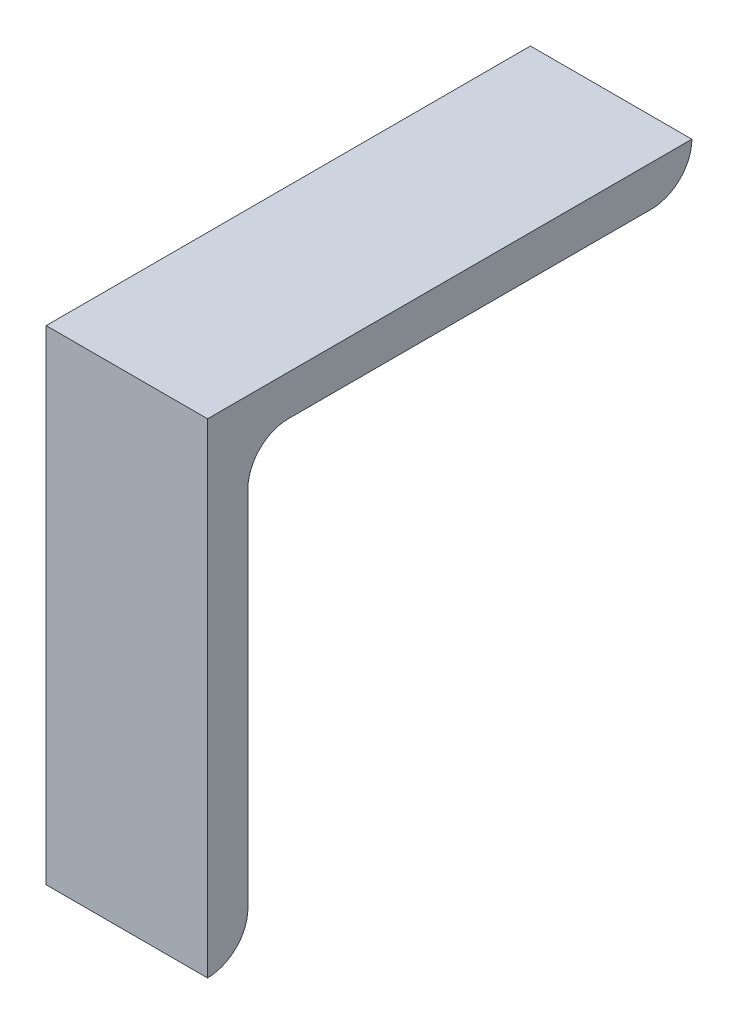
ISO-10303-21;
HEADER;
FILE_DESCRIPTION(('STEP AP214'),'2;1');
FILE_NAME('part.step','',(''),(''),'','','');
FILE_SCHEMA(('AUTOMOTIVE_DESIGN { 1 0 10303 214 1 1 1 1 }'));
ENDSEC;
DATA;
#1=APPLICATION_CONTEXT('core data for automotive mechanical design processes');
#2=APPLICATION_PROTOCOL_DEFINITION('international standard','automotive_design',2000,#1);
#3=PRODUCT_CONTEXT('',#1,'mechanical');
#4=PRODUCT('Part','Part','',(#3));
#5=PRODUCT_RELATED_PRODUCT_CATEGORY('part','',(#4));
#6=PRODUCT_DEFINITION_FORMATION('','',#4);
#7=PRODUCT_DEFINITION_CONTEXT('part definition',#1,'design');
#8=PRODUCT_DEFINITION('design','',#6,#7);
#9=PRODUCT_DEFINITION_SHAPE('','',#8);
#10=(LENGTH_UNIT() NAMED_UNIT(*) SI_UNIT(.MILLI.,.METRE.));
#11=(NAMED_UNIT(*) PLANE_ANGLE_UNIT() SI_UNIT($,.RADIAN.));
#12=(NAMED_UNIT(*) SI_UNIT($,.STERADIAN.) SOLID_ANGLE_UNIT());
#13=UNCERTAINTY_MEASURE_WITH_UNIT(LENGTH_MEASURE(1.E-05),#10,'distance_accuracy_value','');
#14=(GEOMETRIC_REPRESENTATION_CONTEXT(3) GLOBAL_UNCERTAINTY_ASSIGNED_CONTEXT((#13)) GLOBAL_UNIT_ASSIGNED_CONTEXT((#10,
#11,#12)) REPRESENTATION_CONTEXT('',''));
#15=CARTESIAN_POINT('',(0.,0.,0.));
#16=DIRECTION('',(0.,0.,1.));
#17=DIRECTION('',(1.,0.,0.));
#18=AXIS2_PLACEMENT_3D('',#15,#16,#17);
#19=CARTESIAN_POINT('',(45.81144,0.,-69.85));
#20=DIRECTION('',(-1.,0.,0.));
#21=DIRECTION('',(0.,0.,1.));
#22=AXIS2_PLACEMENT_3D('',#19,#20,#21);
#23=CYLINDRICAL_SURFACE('',#22,6.35);
#24=DIRECTION('',(1.,0.,0.));
#25=VECTOR('',#24,1.);
#26=CARTESIAN_POINT('',(-12.7,-6.35,-69.85));
#27=LINE('',#26,#25);
#28=CARTESIAN_POINT('',(-12.7,-6.35,-69.85));
#29=VERTEX_POINT('',#28);
#30=CARTESIAN_POINT('',(12.7,-6.35,-69.85));
#31=VERTEX_POINT('',#30);
#32=EDGE_CURVE('E86',#29,#31,#27,.T.);
#33=ORIENTED_EDGE('',*,*,#32,.F.);
#34=CARTESIAN_POINT('',(-12.7,0.,-69.85));
#35=DIRECTION('',(-1.,0.,0.));
#36=DIRECTION('',(0.,0.,1.));
#37=AXIS2_PLACEMENT_3D('',#34,#35,#36);
#38=CIRCLE('',#37,6.35);
#39=CARTESIAN_POINT('',(-12.7,0.,-76.2));
#40=VERTEX_POINT('',#39);
#41=EDGE_CURVE('E111',#29,#40,#38,.F.);
#42=ORIENTED_EDGE('',*,*,#41,.T.);
#43=DIRECTION('',(1.,0.,0.));
#44=VECTOR('',#43,1.);
#45=CARTESIAN_POINT('',(-12.7,0.,-76.2));
#46=LINE('',#45,#44);
#47=CARTESIAN_POINT('',(12.7,0.,-76.2));
#48=VERTEX_POINT('',#47);
#49=EDGE_CURVE('E108',#48,#40,#46,.F.);
#50=ORIENTED_EDGE('',*,*,#49,.F.);
#51=CARTESIAN_POINT('',(12.7,0.,-69.85));
#52=DIRECTION('',(-1.,0.,0.));
#53=DIRECTION('',(0.,0.,1.));
#54=AXIS2_PLACEMENT_3D('',#51,#52,#53);
#55=CIRCLE('',#54,6.35);
#56=EDGE_CURVE('E93',#31,#48,#55,.F.);
#57=ORIENTED_EDGE('',*,*,#56,.F.);
#58=EDGE_LOOP('',(#33,#42,#50,#57));
#59=FACE_BOUND('',#58,.T.);
#60=ADVANCED_FACE('F16',(#59),#23,.T.);
#61=CARTESIAN_POINT('',(-45.81144,-12.7,-12.7));
#62=DIRECTION('',(1.,0.,0.));
#63=DIRECTION('',(0.,0.,-1.));
#64=AXIS2_PLACEMENT_3D('',#61,#62,#63);
#65=CYLINDRICAL_SURFACE('',#64,6.35);
#66=DIRECTION('',(-1.,0.,0.));
#67=VECTOR('',#66,1.);
#68=CARTESIAN_POINT('',(-12.7,-12.7,-6.35));
#69=LINE('',#68,#67);
#70=CARTESIAN_POINT('',(-12.7,-12.7,-6.35));
#71=VERTEX_POINT('',#70);
#72=CARTESIAN_POINT('',(12.7,-12.7,-6.35));
#73=VERTEX_POINT('',#72);
#74=EDGE_CURVE('E71',#71,#73,#69,.F.);
#75=ORIENTED_EDGE('',*,*,#74,.F.);
#76=CARTESIAN_POINT('',(-12.7,-12.7,-12.7));
#77=DIRECTION('',(1.,0.,0.));
#78=DIRECTION('',(0.,0.,-1.));
#79=AXIS2_PLACEMENT_3D('',#76,#77,#78);
#80=CIRCLE('',#79,6.35);
#81=CARTESIAN_POINT('',(-12.7,-6.35,-12.7));
#82=VERTEX_POINT('',#81);
#83=EDGE_CURVE('E82',#71,#82,#80,.F.);
#84=ORIENTED_EDGE('',*,*,#83,.T.);
#85=DIRECTION('',(1.,0.,0.));
#86=VECTOR('',#85,1.);
#87=CARTESIAN_POINT('',(-12.7,-6.35,-12.7));
#88=LINE('',#87,#86);
#89=CARTESIAN_POINT('',(12.7,-6.35,-12.7));
#90=VERTEX_POINT('',#89);
#91=EDGE_CURVE('E76',#90,#82,#88,.F.);
#92=ORIENTED_EDGE('',*,*,#91,.F.);
#93=CARTESIAN_POINT('',(12.7,-12.7,-12.7));
#94=DIRECTION('',(1.,0.,0.));
#95=DIRECTION('',(0.,0.,-1.));
#96=AXIS2_PLACEMENT_3D('',#93,#94,#95);
#97=CIRCLE('',#96,6.35);
#98=EDGE_CURVE('E19',#73,#90,#97,.F.);
#99=ORIENTED_EDGE('',*,*,#98,.F.);
#100=EDGE_LOOP('',(#75,#84,#92,#99));
#101=FACE_BOUND('',#100,.T.);
#102=ADVANCED_FACE('F78',(#101),#65,.F.);
#103=CARTESIAN_POINT('',(-12.7,-6.35,-6.35));
#104=DIRECTION('',(0.,-1.,0.));
#105=DIRECTION('',(0.,0.,-1.));
#106=AXIS2_PLACEMENT_3D('',#103,#104,#105);
#107=PLANE('',#106);
#108=DIRECTION('',(0.,0.,-1.));
#109=VECTOR('',#108,1.);
#110=CARTESIAN_POINT('',(-12.7,-6.35,0.));
#111=LINE('',#110,#109);
#112=EDGE_CURVE('E105',#82,#29,#111,.T.);
#113=ORIENTED_EDGE('',*,*,#112,.T.);
#114=ORIENTED_EDGE('',*,*,#32,.T.);
#115=DIRECTION('',(0.,0.,-1.));
#116=VECTOR('',#115,1.);
#117=CARTESIAN_POINT('',(12.7,-6.35,0.));
#118=LINE('',#117,#116);
#119=EDGE_CURVE('E89',#90,#31,#118,.T.);
#120=ORIENTED_EDGE('',*,*,#119,.F.);
#121=ORIENTED_EDGE('',*,*,#91,.T.);
#122=EDGE_LOOP('',(#113,#114,#120,#121));
#123=FACE_BOUND('',#122,.T.);
#124=ADVANCED_FACE('F90',(#123),#107,.T.);
#125=CARTESIAN_POINT('',(-12.7,-76.2,-6.35));
#126=DIRECTION('',(0.,0.,-1.));
#127=DIRECTION('',(-1.,0.,0.));
#128=AXIS2_PLACEMENT_3D('',#125,#126,#127);
#129=PLANE('',#128);
#130=DIRECTION('',(0.,1.,0.));
#131=VECTOR('',#130,1.);
#132=CARTESIAN_POINT('',(12.7,0.,-6.35));
#133=LINE('',#132,#131);
#134=CARTESIAN_POINT('',(12.7,-69.85,-6.35));
#135=VERTEX_POINT('',#134);
#136=EDGE_CURVE('E97',#135,#73,#133,.T.);
#137=ORIENTED_EDGE('',*,*,#136,.F.);
#138=DIRECTION('',(-1.,0.,0.));
#139=VECTOR('',#138,1.);
#140=CARTESIAN_POINT('',(45.81144,-69.85,-6.35));
#141=LINE('',#140,#139);
#142=CARTESIAN_POINT('',(-12.7,-69.85,-6.35));
#143=VERTEX_POINT('',#142);
#144=EDGE_CURVE('E102',#143,#135,#141,.F.);
#145=ORIENTED_EDGE('',*,*,#144,.F.);
#146=DIRECTION('',(0.,1.,0.));
#147=VECTOR('',#146,1.);
#148=CARTESIAN_POINT('',(-12.7,0.,-6.35));
#149=LINE('',#148,#147);
#150=EDGE_CURVE('E118',#143,#71,#149,.T.);
#151=ORIENTED_EDGE('',*,*,#150,.T.);
#152=ORIENTED_EDGE('',*,*,#74,.T.);
#153=EDGE_LOOP('',(#137,#145,#151,#152));
#154=FACE_BOUND('',#153,.T.);
#155=ADVANCED_FACE('F154',(#154),#129,.T.);
#156=CARTESIAN_POINT('',(12.7,0.,0.));
#157=DIRECTION('',(1.,0.,0.));
#158=DIRECTION('',(0.,0.,-1.));
#159=AXIS2_PLACEMENT_3D('',#156,#157,#158);
#160=PLANE('',#159);
#161=ORIENTED_EDGE('',*,*,#119,.T.);
#162=ORIENTED_EDGE('',*,*,#56,.T.);
#163=DIRECTION('',(0.,0.,1.));
#164=VECTOR('',#163,1.);
#165=CARTESIAN_POINT('',(12.7,0.,-76.2));
#166=LINE('',#165,#164);
#167=CARTESIAN_POINT('',(12.7,0.,0.));
#168=VERTEX_POINT('',#167);
#169=EDGE_CURVE('E112',#168,#48,#166,.F.);
#170=ORIENTED_EDGE('',*,*,#169,.F.);
#171=DIRECTION('',(0.,1.,0.));
#172=VECTOR('',#171,1.);
#173=CARTESIAN_POINT('',(12.7,0.,0.));
#174=LINE('',#173,#172);
#175=CARTESIAN_POINT('',(12.7,-76.2,0.));
#176=VERTEX_POINT('',#175);
#177=EDGE_CURVE('E114',#176,#168,#174,.T.);
#178=ORIENTED_EDGE('',*,*,#177,.F.);
#179=CARTESIAN_POINT('',(12.7,-69.85,0.));
#180=DIRECTION('',(-1.,0.,0.));
#181=DIRECTION('',(0.,0.,1.));
#182=AXIS2_PLACEMENT_3D('',#179,#180,#181);
#183=CIRCLE('',#182,6.35);
#184=EDGE_CURVE('E104',#135,#176,#183,.T.);
#185=ORIENTED_EDGE('',*,*,#184,.F.);
#186=ORIENTED_EDGE('',*,*,#136,.T.);
#187=ORIENTED_EDGE('',*,*,#98,.T.);
#188=EDGE_LOOP('',(#161,#162,#170,#178,#185,#186,#187));
#189=FACE_BOUND('',#188,.T.);
#190=ADVANCED_FACE('F95',(#189),#160,.T.);
#191=CARTESIAN_POINT('',(-12.7,0.,-76.2));
#192=DIRECTION('',(0.,1.,0.));
#193=DIRECTION('',(0.,0.,1.));
#194=AXIS2_PLACEMENT_3D('',#191,#192,#193);
#195=PLANE('',#194);
#196=ORIENTED_EDGE('',*,*,#169,.T.);
#197=ORIENTED_EDGE('',*,*,#49,.T.);
#198=DIRECTION('',(0.,0.,-1.));
#199=VECTOR('',#198,1.);
#200=CARTESIAN_POINT('',(-12.7,0.,0.));
#201=LINE('',#200,#199);
#202=CARTESIAN_POINT('',(-12.7,0.,0.));
#203=VERTEX_POINT('',#202);
#204=EDGE_CURVE('E119',#40,#203,#201,.F.);
#205=ORIENTED_EDGE('',*,*,#204,.T.);
#206=DIRECTION('',(1.,0.,0.));
#207=VECTOR('',#206,1.);
#208=CARTESIAN_POINT('',(-12.7,0.,0.));
#209=LINE('',#208,#207);
#210=EDGE_CURVE('E133',#168,#203,#209,.F.);
#211=ORIENTED_EDGE('',*,*,#210,.F.);
#212=EDGE_LOOP('',(#196,#197,#205,#211));
#213=FACE_BOUND('',#212,.T.);
#214=ADVANCED_FACE('F150',(#213),#195,.T.);
#215=CARTESIAN_POINT('',(-12.7,0.,0.));
#216=DIRECTION('',(1.,0.,0.));
#217=DIRECTION('',(0.,0.,-1.));
#218=AXIS2_PLACEMENT_3D('',#215,#216,#217);
#219=PLANE('',#218);
#220=ORIENTED_EDGE('',*,*,#83,.F.);
#221=ORIENTED_EDGE('',*,*,#150,.F.);
#222=CARTESIAN_POINT('',(-12.7,-69.85,0.));
#223=DIRECTION('',(-1.,0.,0.));
#224=DIRECTION('',(0.,0.,1.));
#225=AXIS2_PLACEMENT_3D('',#222,#223,#224);
#226=CIRCLE('',#225,6.35);
#227=CARTESIAN_POINT('',(-12.7,-76.2,0.));
#228=VERTEX_POINT('',#227);
#229=EDGE_CURVE('E34',#228,#143,#226,.F.);
#230=ORIENTED_EDGE('',*,*,#229,.F.);
#231=DIRECTION('',(0.,1.,0.));
#232=VECTOR('',#231,1.);
#233=CARTESIAN_POINT('',(-12.7,0.,0.));
#234=LINE('',#233,#232);
#235=EDGE_CURVE('E25',#203,#228,#234,.F.);
#236=ORIENTED_EDGE('',*,*,#235,.F.);
#237=ORIENTED_EDGE('',*,*,#204,.F.);
#238=ORIENTED_EDGE('',*,*,#41,.F.);
#239=ORIENTED_EDGE('',*,*,#112,.F.);
#240=EDGE_LOOP('',(#220,#221,#230,#236,#237,#238,#239));
#241=FACE_BOUND('',#240,.T.);
#242=ADVANCED_FACE('F148',(#241),#219,.F.);
#243=CARTESIAN_POINT('',(45.81144,-69.85,0.));
#244=DIRECTION('',(-1.,0.,0.));
#245=DIRECTION('',(0.,0.,1.));
#246=AXIS2_PLACEMENT_3D('',#243,#244,#245);
#247=CYLINDRICAL_SURFACE('',#246,6.35);
#248=DIRECTION('',(1.,0.,0.));
#249=VECTOR('',#248,1.);
#250=CARTESIAN_POINT('',(-12.7,-76.2,0.));
#251=LINE('',#250,#249);
#252=EDGE_CURVE('E11',#228,#176,#251,.T.);
#253=ORIENTED_EDGE('',*,*,#252,.F.);
#254=ORIENTED_EDGE('',*,*,#229,.T.);
#255=ORIENTED_EDGE('',*,*,#144,.T.);
#256=ORIENTED_EDGE('',*,*,#184,.T.);
#257=EDGE_LOOP('',(#253,#254,#255,#256));
#258=FACE_BOUND('',#257,.T.);
#259=ADVANCED_FACE('F153',(#258),#247,.T.);
#260=CARTESIAN_POINT('',(-12.7,0.,0.));
#261=DIRECTION('',(0.,0.,1.));
#262=DIRECTION('',(1.,0.,0.));
#263=AXIS2_PLACEMENT_3D('',#260,#261,#262);
#264=PLANE('',#263);
#265=ORIENTED_EDGE('',*,*,#235,.T.);
#266=ORIENTED_EDGE('',*,*,#252,.T.);
#267=ORIENTED_EDGE('',*,*,#177,.T.);
#268=ORIENTED_EDGE('',*,*,#210,.T.);
#269=EDGE_LOOP('',(#265,#266,#267,#268));
#270=FACE_BOUND('',#269,.T.);
#271=ADVANCED_FACE('F151',(#270),#264,.T.);
#272=CLOSED_SHELL('',(#60,#102,#124,#155,#190,#214,#242,#259,#271));
#273=MANIFOLD_SOLID_BREP('B1',#272);
#274=ADVANCED_BREP_SHAPE_REPRESENTATION('',(#18,#273),#14);
#275=SHAPE_DEFINITION_REPRESENTATION(#9,#274);
ENDSEC;
END-ISO-10303-21;
